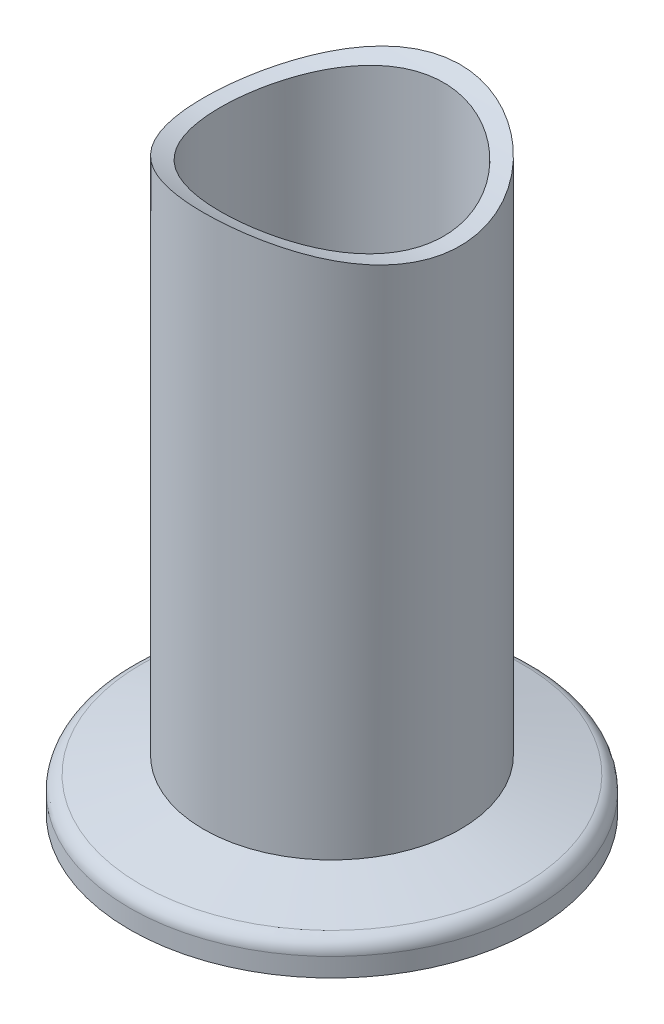
ISO-10303-21;
HEADER;
FILE_DESCRIPTION(('STEP AP214'),'2;1');
FILE_NAME('part.step','',(''),(''),'','','');
FILE_SCHEMA(('AUTOMOTIVE_DESIGN { 1 0 10303 214 1 1 1 1 }'));
ENDSEC;
DATA;
#1=APPLICATION_CONTEXT('core data for automotive mechanical design processes');
#2=APPLICATION_PROTOCOL_DEFINITION('international standard','automotive_design',2000,#1);
#3=PRODUCT_CONTEXT('',#1,'mechanical');
#4=PRODUCT('Part','Part','',(#3));
#5=PRODUCT_RELATED_PRODUCT_CATEGORY('part','',(#4));
#6=PRODUCT_DEFINITION_FORMATION('','',#4);
#7=PRODUCT_DEFINITION_CONTEXT('part definition',#1,'design');
#8=PRODUCT_DEFINITION('design','',#6,#7);
#9=PRODUCT_DEFINITION_SHAPE('','',#8);
#10=(LENGTH_UNIT() NAMED_UNIT(*) SI_UNIT(.MILLI.,.METRE.));
#11=(NAMED_UNIT(*) PLANE_ANGLE_UNIT() SI_UNIT($,.RADIAN.));
#12=(NAMED_UNIT(*) SI_UNIT($,.STERADIAN.) SOLID_ANGLE_UNIT());
#13=UNCERTAINTY_MEASURE_WITH_UNIT(LENGTH_MEASURE(1.E-05),#10,'distance_accuracy_value','');
#14=(GEOMETRIC_REPRESENTATION_CONTEXT(3) GLOBAL_UNCERTAINTY_ASSIGNED_CONTEXT((#13)) GLOBAL_UNIT_ASSIGNED_CONTEXT((#10,
#11,#12)) REPRESENTATION_CONTEXT('',''));
#15=CARTESIAN_POINT('',(0.,0.,0.));
#16=DIRECTION('',(0.,0.,1.));
#17=DIRECTION('',(1.,0.,0.));
#18=AXIS2_PLACEMENT_3D('',#15,#16,#17);
#19=CARTESIAN_POINT('',(0.,0.,0.));
#20=DIRECTION('',(0.,1.,0.));
#21=DIRECTION('',(0.,0.,1.));
#22=AXIS2_PLACEMENT_3D('',#19,#20,#21);
#23=CYLINDRICAL_SURFACE('',#22,12.7);
#24=CARTESIAN_POINT('',(0.,57.8030088282057,12.7));
#25=CARTESIAN_POINT('',(0.337966667612661,57.8030061327463,12.6999974802343));
#26=CARTESIAN_POINT('',(0.676043453065338,57.7966182835198,12.6864898318672));
#27=CARTESIAN_POINT('',(1.34972280775874,57.771278414815,12.6325992349375));
#28=CARTESIAN_POINT('',(1.68532367760534,57.7523184545045,12.5921993005315));
#29=CARTESIAN_POINT('',(2.35217061314407,57.7024292254738,12.4848547611177));
#30=CARTESIAN_POINT('',(2.68340452810274,57.6714718063177,12.4178477169149));
#31=CARTESIAN_POINT('',(3.33828785092914,57.5986361324553,12.2580356692884));
#32=CARTESIAN_POINT('',(3.66193837200279,57.5567594917241,12.1652344783752));
#33=CARTESIAN_POINT('',(4.29825940919649,57.4636196928336,11.9551977985834));
#34=CARTESIAN_POINT('',(4.61097047971219,57.412396870839,11.8380670215021));
#35=CARTESIAN_POINT('',(5.22501932792218,57.3019767853066,11.5801588828009));
#36=CARTESIAN_POINT('',(5.52635671433382,57.2427792477387,11.4393807085591));
#37=CARTESIAN_POINT('',(6.11590510471372,57.1181004070452,11.1353339021782));
#38=CARTESIAN_POINT('',(6.40412221208047,57.0526220706448,10.972075872646));
#39=CARTESIAN_POINT('',(6.96626047190927,56.9170594482911,10.6240549591742));
#40=CARTESIAN_POINT('',(7.24017636312289,56.8469734883729,10.4392842405965));
#41=CARTESIAN_POINT('',(7.78806715532096,56.6997298727472,10.0378316954649));
#42=CARTESIAN_POINT('',(8.06108678115527,56.6223991530217,9.81990866099743));
#43=CARTESIAN_POINT('',(8.58808973663291,56.4666168914696,9.3625031081281));
#44=CARTESIAN_POINT('',(8.84207230404262,56.3881653049137,9.12301972730567));
#45=CARTESIAN_POINT('',(9.32974520607019,56.2321245609378,8.62367146880821));
#46=CARTESIAN_POINT('',(9.56342411158536,56.1545359104249,8.36379526647405));
#47=CARTESIAN_POINT('',(10.0088686096585,56.0022636552798,7.82525528157904));
#48=CARTESIAN_POINT('',(10.2206417126304,55.9275790605081,7.54659799259991));
#49=CARTESIAN_POINT('',(10.6302435859891,55.7796323666945,6.95860255562527));
#50=CARTESIAN_POINT('',(10.8269750880218,55.7065956508943,6.64844157888177));
#51=CARTESIAN_POINT('',(11.1934462571668,55.5677901230862,6.01098351786343));
#52=CARTESIAN_POINT('',(11.3631848591593,55.5020215979069,5.68368575806093));
#53=CARTESIAN_POINT('',(11.6740486890053,55.3796673180838,5.01425191711402));
#54=CARTESIAN_POINT('',(11.8151842556186,55.323078246946,4.67212125189947));
#55=CARTESIAN_POINT('',(12.0674521674993,55.2207345111884,3.97540310396765));
#56=CARTESIAN_POINT('',(12.1785867306283,55.1749790457114,3.62081654425934));
#57=CARTESIAN_POINT('',(12.3644044197808,55.0978502925402,2.92150658714544));
#58=CARTESIAN_POINT('',(12.440738986275,55.0658310367963,2.57729288775198));
#59=CARTESIAN_POINT('',(12.5646062107959,55.013628304745,1.88283172671388));
#60=CARTESIAN_POINT('',(12.612139823187,54.9934444362545,1.53258446539629));
#61=CARTESIAN_POINT('',(12.6778387022792,54.9654976744835,0.828979889260723));
#62=CARTESIAN_POINT('',(12.6960146201975,54.9577302764143,0.475623749173587));
#63=CARTESIAN_POINT('',(12.7028114073386,54.9548290815981,-0.231418048780089));
#64=CARTESIAN_POINT('',(12.6914334906051,54.9596947658961,-0.585103692514299));
#65=CARTESIAN_POINT('',(12.6409356437175,54.981203029045,-1.26734899892231));
#66=CARTESIAN_POINT('',(12.6036353965208,54.9970729801937,-1.59606968833555));
#67=CARTESIAN_POINT('',(12.503655040455,55.0393502172284,-2.24892275822736));
#68=CARTESIAN_POINT('',(12.4409762243434,55.06575696638,-2.57305537154739));
#69=CARTESIAN_POINT('',(12.2908559746949,55.1284532245096,-3.21455865213643));
#70=CARTESIAN_POINT('',(12.2034136884611,55.1647430737972,-3.53192908615418));
#71=CARTESIAN_POINT('',(12.0045762984694,55.2463254896933,-4.15788370696592));
#72=CARTESIAN_POINT('',(11.8931804637008,55.2916183310506,-4.46646762528884));
#73=CARTESIAN_POINT('',(11.6455124939983,55.3908897072664,-5.07763834921836));
#74=CARTESIAN_POINT('',(11.5088869984911,55.444990132714,-5.38006200303765));
#75=CARTESIAN_POINT('',(11.2130185467921,55.5600908256936,-5.97225090629107));
#76=CARTESIAN_POINT('',(11.0537755415261,55.6210911081965,-6.26201612825794));
#77=CARTESIAN_POINT('',(10.7137909179858,55.7485950823373,-6.82740900951455));
#78=CARTESIAN_POINT('',(10.5330469412518,55.8150993774711,-7.10303511311769));
#79=CARTESIAN_POINT('',(10.1511591958667,55.9521291981164,-7.63886491712118));
#80=CARTESIAN_POINT('',(9.95000752243011,56.0226562771603,-7.89906257910987));
#81=CARTESIAN_POINT('',(9.51304274723571,56.1713967687574,-8.42117801865003));
#82=CARTESIAN_POINT('',(9.27576957001009,56.2497945738192,-8.68182274892644));
#83=CARTESIAN_POINT('',(8.78052275905956,56.4073546614007,-9.18239588296409));
#84=CARTESIAN_POINT('',(8.52254842513068,56.4865169696995,-9.42232358541421));
#85=CARTESIAN_POINT('',(7.98723422911562,56.6435465744278,-9.88019119199024));
#86=CARTESIAN_POINT('',(7.7098876415255,56.7214134093718,-10.0981233950494));
#87=CARTESIAN_POINT('',(7.13735252721722,56.8737070425595,-10.5105995002396));
#88=CARTESIAN_POINT('',(6.84216130411783,56.9481333179102,-10.7051398544462));
#89=CARTESIAN_POINT('',(6.22456415326808,57.0939944023599,-11.0760641781687));
#90=CARTESIAN_POINT('',(5.90155968174794,57.1652230991225,-11.25153483711));
#91=CARTESIAN_POINT('',(5.24027293932176,57.2993107427972,-11.5743181782834));
#92=CARTESIAN_POINT('',(4.90199753301278,57.3621734012172,-11.7216433596896));
#93=CARTESIAN_POINT('',(4.21244287313947,57.4773365456783,-11.9867301845126));
#94=CARTESIAN_POINT('',(3.86116861938318,57.5296410437991,-12.1045030618964));
#95=CARTESIAN_POINT('',(3.14814984961279,57.6217449858774,-12.3092114159778));
#96=CARTESIAN_POINT('',(2.78640632612038,57.6615456110303,-12.3961498055969));
#97=CARTESIAN_POINT('',(2.07999159044066,57.7248591081134,-12.5333265928779));
#98=CARTESIAN_POINT('',(1.7358037542267,57.7492857627233,-12.5856362950555));
#99=CARTESIAN_POINT('',(1.04361819608748,57.7849923664133,-12.6618351352494));
#100=CARTESIAN_POINT('',(0.695620647805092,57.7962729121827,-12.68572556319));
#101=CARTESIAN_POINT('',(-0.00122065961250493,57.8052641017779,-12.7047807071719));
#102=CARTESIAN_POINT('',(-0.350064106656494,57.8029791586195,-12.6999547649905));
#103=CARTESIAN_POINT('',(-1.04581526609033,57.7849350330202,-12.6616603408621));
#104=CARTESIAN_POINT('',(-1.39272304219663,57.7691762967613,-12.6281928073755));
#105=CARTESIAN_POINT('',(-2.05806925529534,57.726303598872,-12.5363179372171));
#106=CARTESIAN_POINT('',(-2.37682436573281,57.700045434639,-12.4797847987945));
#107=CARTESIAN_POINT('',(-3.008097320123,57.6371814615137,-12.3428383187926));
#108=CARTESIAN_POINT('',(-3.32061550899981,57.6005762265588,-12.2624263017282));
#109=CARTESIAN_POINT('',(-3.93750282258498,57.5181096275995,-12.0784799731984));
#110=CARTESIAN_POINT('',(-4.24187192779833,57.472248241454,-11.9749456064231));
#111=CARTESIAN_POINT('',(-4.84086694155246,57.3725473892013,-11.7455909527416));
#112=CARTESIAN_POINT('',(-5.13548897858233,57.3187047984319,-11.619761933636));
#113=CARTESIAN_POINT('',(-5.72576048759727,57.2020372352126,-11.3409316083568));
#114=CARTESIAN_POINT('',(-6.02091205241725,57.138926054436,-11.1869963509737));
#115=CARTESIAN_POINT('',(-6.59745572675304,57.0072909384594,-10.8569777603475));
#116=CARTESIAN_POINT('',(-6.87884172105822,56.938764632372,-10.6808847056151));
#117=CARTESIAN_POINT('',(-7.42641092739612,56.798072398071,-10.3076775764155));
#118=CARTESIAN_POINT('',(-7.69259165269597,56.7259058781351,-10.1105600785516));
#119=CARTESIAN_POINT('',(-8.20845492653064,56.5797063352229,-9.69642650917383));
#120=CARTESIAN_POINT('',(-8.45813669893488,56.5056732246659,-9.47940950270815));
#121=CARTESIAN_POINT('',(-8.96066245980031,56.3510654367521,-9.00697068974137));
#122=CARTESIAN_POINT('',(-9.21190940015589,56.2704792236385,-8.7498505927576));
#123=CARTESIAN_POINT('',(-9.69191134765971,56.1113726135354,-8.21498247880631));
#124=CARTESIAN_POINT('',(-9.9206738311838,56.0328515362655,-7.93724137288526));
#125=CARTESIAN_POINT('',(-10.3543722540419,55.8799241232123,-7.36251373145176));
#126=CARTESIAN_POINT('',(-10.5593004871702,55.8055191223137,-7.06552101948536));
#127=CARTESIAN_POINT('',(-10.9437203533913,55.662860352827,-6.45409786311612));
#128=CARTESIAN_POINT('',(-11.1232125300577,55.5946064528,-6.13966779155303));
#129=CARTESIAN_POINT('',(-11.4560342077919,55.4658246786327,-5.49380200425907));
#130=CARTESIAN_POINT('',(-11.6092380168829,55.405334252735,-5.16229393290836));
#131=CARTESIAN_POINT('',(-11.8869947234331,55.2941788493711,-4.48586894987199));
#132=CARTESIAN_POINT('',(-12.0115472349667,55.2435140042544,-4.14095185764339));
#133=CARTESIAN_POINT('',(-12.2306134861211,55.1535261468516,-3.44044930674045));
#134=CARTESIAN_POINT('',(-12.3251427110732,55.1141972886913,-3.08486945159388));
#135=CARTESIAN_POINT('',(-12.4831396497163,55.0480434215442,-2.36573843304101));
#136=CARTESIAN_POINT('',(-12.5466098386931,55.021217416136,-2.00218790728006));
#137=CARTESIAN_POINT('',(-12.6382444814566,54.982366023112,-1.29687727341984));
#138=CARTESIAN_POINT('',(-12.6686424546522,54.9694054729741,-0.9554571569384));
#139=CARTESIAN_POINT('',(-12.7017281344655,54.9552952239367,-0.271040365500603));
#140=CARTESIAN_POINT('',(-12.7044172604557,54.9541449200629,0.071956227801012));
#141=CARTESIAN_POINT('',(-12.6820582364973,54.9636855176633,0.756815057904461));
#142=CARTESIAN_POINT('',(-12.6570148307319,54.974374393818,1.09867747869524));
#143=CARTESIAN_POINT('',(-12.5794796602576,55.0072988750264,1.77870775903798));
#144=CARTESIAN_POINT('',(-12.5269881167943,55.0295343870085,2.11687564834725));
#145=CARTESIAN_POINT('',(-12.3976833000467,55.0838793286209,2.77402693420548));
#146=CARTESIAN_POINT('',(-12.3218897905213,55.1155733779091,3.09324632537784));
#147=CARTESIAN_POINT('',(-12.1461903928166,55.1883047897486,3.72386832392965));
#148=CARTESIAN_POINT('',(-12.0462853386826,55.2293418291124,4.03527120127987));
#149=CARTESIAN_POINT('',(-11.8232468951465,55.3197860330082,4.64835885453756));
#150=CARTESIAN_POINT('',(-11.7001147070444,55.3691927646489,4.95004413209194));
#151=CARTESIAN_POINT('',(-11.4315587878541,55.4752607586568,5.54212825253603));
#152=CARTESIAN_POINT('',(-11.2861264098466,55.5319248336556,5.83252266239228));
#153=CARTESIAN_POINT('',(-10.9670070999349,55.6539201328072,6.4132220240345));
#154=CARTESIAN_POINT('',(-10.7923408873164,55.7195271806138,6.7029308659257));
#155=CARTESIAN_POINT('',(-10.4210042161936,55.8557260472695,7.26682180017757));
#156=CARTESIAN_POINT('',(-10.2243239749792,55.9263200770788,7.540996907408));
#157=CARTESIAN_POINT('',(-9.81023862895041,56.0708123833086,8.07234038070148));
#158=CARTESIAN_POINT('',(-9.59283116344829,56.1447110355926,8.32950680392994));
#159=CARTESIAN_POINT('',(-9.1385428785784,56.294069459647,8.82553987331999));
#160=CARTESIAN_POINT('',(-8.90166128011877,56.3695292937843,9.06440578660298));
#161=CARTESIAN_POINT('',(-8.39186630094811,56.525665847573,9.53920926028083));
#162=CARTESIAN_POINT('',(-8.1175861177866,56.60632544622,9.77368745733191));
#163=CARTESIAN_POINT('',(-7.54971513534199,56.7650838685574,10.2187028814211));
#164=CARTESIAN_POINT('',(-7.25613113842312,56.8431835799285,10.4292484713267));
#165=CARTESIAN_POINT('',(-6.65094548630251,56.9946289736625,10.8252385804105));
#166=CARTESIAN_POINT('',(-6.33932875267145,57.0679705654981,11.0106616471133));
#167=CARTESIAN_POINT('',(-5.70013805783453,57.2075411337302,11.3547410749687));
#168=CARTESIAN_POINT('',(-5.37256519908249,57.2737706005133,11.5133992820099));
#169=CARTESIAN_POINT('',(-4.70427332156241,57.396779830545,11.8022033517062));
#170=CARTESIAN_POINT('',(-4.36358633031622,57.4535810142598,11.9324140643441));
#171=CARTESIAN_POINT('',(-3.67064877334715,57.5559135266228,12.1634583268609));
#172=CARTESIAN_POINT('',(-3.31839619494383,57.6014428818114,12.2642867330638));
#173=CARTESIAN_POINT('',(-2.60619472215657,57.6793787221364,12.4350902538913));
#174=CARTESIAN_POINT('',(-2.24627200854666,57.7118240633302,12.5051567789698));
#175=CARTESIAN_POINT('',(-1.52091630213525,57.7624764289002,12.6139254583757));
#176=CARTESIAN_POINT('',(-1.15548776109444,57.7806943868924,12.6526516982619));
#177=CARTESIAN_POINT('',(-0.657692861943612,57.7952921559354,12.683642206207));
#178=CARTESIAN_POINT('',(-0.526252650435774,57.7981836935589,12.689774385749));
#179=CARTESIAN_POINT('',(-0.263213860922235,57.8020425689272,12.6979538038194));
#180=CARTESIAN_POINT('',(-0.131615280578433,57.8030098779058,12.7000009812792));
#181=CARTESIAN_POINT('',(0.,57.8030088282057,12.7));
#182=B_SPLINE_CURVE_WITH_KNOTS('',3,(#24,#25,#26,#27,#28,#29,#30,#31,#32,#33,#34,#35,#36,#37,
#38,#39,#40,#41,#42,#43,#44,#45,#46,#47,#48,#49,#50,#51,#52,#53,#54,#55,#56,#57,#58,#59,#60,#61,
#62,#63,#64,#65,#66,#67,#68,#69,#70,#71,#72,#73,#74,#75,#76,#77,#78,#79,#80,#81,#82,#83,#84,#85,
#86,#87,#88,#89,#90,#91,#92,#93,#94,#95,#96,#97,#98,#99,#100,#101,#102,#103,#104,#105,#106,#107,
#108,#109,#110,#111,#112,#113,#114,#115,#116,#117,#118,#119,#120,#121,#122,#123,#124,#125,#126,
#127,#128,#129,#130,#131,#132,#133,#134,#135,#136,#137,#138,#139,#140,#141,#142,#143,#144,#145,
#146,#147,#148,#149,#150,#151,#152,#153,#154,#155,#156,#157,#158,#159,#160,#161,#162,#163,#164,
#165,#166,#167,#168,#169,#170,#171,#172,#173,#174,#175,#176,#177,#178,#179,#180,#181),
.UNSPECIFIED.,.T.,.F.,(4,2,2,2,2,2,2,2,2,2,2,2,2,2,2,2,2,2,2,2,2,2,2,2,2,2,2,2,2,2,2,2,2,2,2,2,
2,2,2,2,2,2,2,2,2,2,2,2,2,2,2,2,2,2,2,2,2,2,2,2,2,2,2,2,2,2,2,2,2,2,2,2,2,2,2,2,2,2,4),(0.,
1.01376314708749,2.02816722080144,3.04496601114287,4.06161459311587,5.07397507820695,
6.08637035929852,7.0982897701365,8.11057886828568,9.18275769317648,10.2549794246261,
11.3278008604734,12.4002532513226,13.5222856808528,14.6443623739669,15.7660327586747,
16.8876201997739,17.9483143396816,19.0089733299164,20.0692474176882,21.1294779510895,
22.12194123783,23.1143539758959,24.1068008905164,25.0992780967798,26.1068861210422,
27.1144963315832,28.1222171698357,29.1303298432135,30.2123681202161,31.2944430119412,
32.3768954550891,33.4595118710809,34.5813564669729,35.7027016969099,36.8236200124277,
37.94443240702,38.9900307977784,40.0355817279927,41.0807925466309,42.1259687546695,
43.0992395554611,44.0724563808949,45.0456755343429,46.019276716892,47.0346357048941,
48.050441733961,49.0664134193239,50.0824328632439,51.1863988358599,52.2899964745945,
53.3939499477258,54.4978798255896,55.6069491039116,56.7160333202399,57.8245445635711,
58.9329674484206,59.9607122974103,60.9884045003957,62.0159209240135,63.0434290654717,
64.0311763792922,65.0188895307153,66.0065516119223,66.994597632989,68.0272575112999,
69.060378124189,70.093616543266,71.1268963187279,72.2348552476072,73.3424258199595,
74.4509362805417,75.5593702593392,76.6652504156139,77.7713240514826,78.8740883140186,
79.9760042759197,80.3707909197452,80.7655834653726),.UNSPECIFIED.);
#183=CARTESIAN_POINT('',(0.,57.8030088282057,12.7));
#184=VERTEX_POINT('',#183);
#185=EDGE_CURVE('E78',#184,#184,#182,.T.);
#186=ORIENTED_EDGE('',*,*,#185,.F.);
#187=EDGE_LOOP('',(#186));
#188=FACE_BOUND('',#187,.T.);
#189=CARTESIAN_POINT('',(0.,4.95602910474715,0.));
#190=DIRECTION('',(0.,1.,0.));
#191=DIRECTION('',(0.,0.,1.));
#192=AXIS2_PLACEMENT_3D('',#189,#190,#191);
#193=CIRCLE('',#192,12.7);
#194=CARTESIAN_POINT('',(0.,4.95602910474715,12.7));
#195=VERTEX_POINT('',#194);
#196=EDGE_CURVE('E10',#195,#195,#193,.T.);
#197=ORIENTED_EDGE('',*,*,#196,.T.);
#198=EDGE_LOOP('',(#197));
#199=FACE_BOUND('',#198,.T.);
#200=ADVANCED_FACE('F37',(#188,#199),#23,.T.);
#201=CARTESIAN_POINT('',(0.,4.95602910474715,0.));
#202=DIRECTION('',(0.,-1.,0.));
#203=DIRECTION('',(0.,0.,-1.));
#204=AXIS2_PLACEMENT_3D('',#201,#202,#203);
#205=CONICAL_SURFACE('',#204,12.7,1.30899693899575);
#206=CARTESIAN_POINT('',(0.,3.29789825746515,0.));
#207=DIRECTION('',(0.,1.,0.));
#208=DIRECTION('',(0.,0.,1.));
#209=AXIS2_PLACEMENT_3D('',#206,#207,#208);
#210=CIRCLE('',#209,18.8882285676538);
#211=CARTESIAN_POINT('',(0.,3.29789825746515,18.8882285676538));
#212=VERTEX_POINT('',#211);
#213=EDGE_CURVE('E51',#212,#212,#210,.T.);
#214=ORIENTED_EDGE('',*,*,#213,.T.);
#215=EDGE_LOOP('',(#214));
#216=FACE_BOUND('',#215,.T.);
#217=ORIENTED_EDGE('',*,*,#196,.F.);
#218=EDGE_LOOP('',(#217));
#219=FACE_BOUND('',#218,.T.);
#220=ADVANCED_FACE('F112',(#216,#219),#205,.T.);
#221=CARTESIAN_POINT('',(0.,1.84900951803155,0.));
#222=DIRECTION('',(0.,1.,0.));
#223=DIRECTION('',(0.,0.,1.));
#224=AXIS2_PLACEMENT_3D('',#221,#222,#223);
#225=TOROIDAL_SURFACE('',#224,18.5,1.5);
#226=CARTESIAN_POINT('',(0.,1.84900951803155,0.));
#227=DIRECTION('',(0.,1.,0.));
#228=DIRECTION('',(0.,0.,1.));
#229=AXIS2_PLACEMENT_3D('',#226,#227,#228);
#230=CIRCLE('',#229,20.);
#231=CARTESIAN_POINT('',(0.,1.84900951803155,20.));
#232=VERTEX_POINT('',#231);
#233=EDGE_CURVE('E56',#232,#232,#230,.T.);
#234=ORIENTED_EDGE('',*,*,#233,.T.);
#235=EDGE_LOOP('',(#234));
#236=FACE_BOUND('',#235,.T.);
#237=ORIENTED_EDGE('',*,*,#213,.F.);
#238=EDGE_LOOP('',(#237));
#239=FACE_BOUND('',#238,.T.);
#240=ADVANCED_FACE('F109',(#236,#239),#225,.T.);
#241=CARTESIAN_POINT('',(0.,0.,0.));
#242=DIRECTION('',(0.,1.,0.));
#243=DIRECTION('',(0.,0.,1.));
#244=AXIS2_PLACEMENT_3D('',#241,#242,#243);
#245=CYLINDRICAL_SURFACE('',#244,20.);
#246=CARTESIAN_POINT('',(0.,0.,0.));
#247=DIRECTION('',(0.,1.,0.));
#248=DIRECTION('',(0.,0.,1.));
#249=AXIS2_PLACEMENT_3D('',#246,#247,#248);
#250=CIRCLE('',#249,20.);
#251=CARTESIAN_POINT('',(0.,0.,20.));
#252=VERTEX_POINT('',#251);
#253=EDGE_CURVE('E62',#252,#252,#250,.T.);
#254=ORIENTED_EDGE('',*,*,#253,.T.);
#255=EDGE_LOOP('',(#254));
#256=FACE_BOUND('',#255,.T.);
#257=ORIENTED_EDGE('',*,*,#233,.F.);
#258=EDGE_LOOP('',(#257));
#259=FACE_BOUND('',#258,.T.);
#260=ADVANCED_FACE('F105',(#256,#259),#245,.T.);
#261=CARTESIAN_POINT('',(20.,0.,0.));
#262=DIRECTION('',(0.,-1.,0.));
#263=DIRECTION('',(0.,0.,-1.));
#264=AXIS2_PLACEMENT_3D('',#261,#262,#263);
#265=PLANE('',#264);
#266=CARTESIAN_POINT('',(0.,0.,0.));
#267=DIRECTION('',(0.,1.,0.));
#268=DIRECTION('',(0.,0.,1.));
#269=AXIS2_PLACEMENT_3D('',#266,#267,#268);
#270=CIRCLE('',#269,11.85);
#271=CARTESIAN_POINT('',(0.,0.,11.85));
#272=VERTEX_POINT('',#271);
#273=EDGE_CURVE('E66',#272,#272,#270,.T.);
#274=ORIENTED_EDGE('',*,*,#273,.T.);
#275=EDGE_LOOP('',(#274));
#276=FACE_BOUND('',#275,.T.);
#277=ORIENTED_EDGE('',*,*,#253,.F.);
#278=EDGE_LOOP('',(#277));
#279=FACE_BOUND('',#278,.T.);
#280=ADVANCED_FACE('F101',(#276,#279),#265,.T.);
#281=CARTESIAN_POINT('',(0.,0.,0.));
#282=DIRECTION('',(0.,1.,0.));
#283=DIRECTION('',(0.,0.,1.));
#284=AXIS2_PLACEMENT_3D('',#281,#282,#283);
#285=CYLINDRICAL_SURFACE('',#284,11.85);
#286=CARTESIAN_POINT('',(0.,2.5,0.));
#287=DIRECTION('',(0.,1.,0.));
#288=DIRECTION('',(0.,0.,1.));
#289=AXIS2_PLACEMENT_3D('',#286,#287,#288);
#290=CIRCLE('',#289,11.85);
#291=CARTESIAN_POINT('',(0.,2.5,11.85));
#292=VERTEX_POINT('',#291);
#293=EDGE_CURVE('E70',#292,#292,#290,.T.);
#294=ORIENTED_EDGE('',*,*,#293,.T.);
#295=EDGE_LOOP('',(#294));
#296=FACE_BOUND('',#295,.T.);
#297=ORIENTED_EDGE('',*,*,#273,.F.);
#298=EDGE_LOOP('',(#297));
#299=FACE_BOUND('',#298,.T.);
#300=ADVANCED_FACE('F97',(#296,#299),#285,.F.);
#301=CARTESIAN_POINT('',(11.85,2.5,0.));
#302=DIRECTION('',(0.,-1.,0.));
#303=DIRECTION('',(0.,0.,-1.));
#304=AXIS2_PLACEMENT_3D('',#301,#302,#303);
#305=PLANE('',#304);
#306=CARTESIAN_POINT('',(0.,2.5,0.));
#307=DIRECTION('',(0.,1.,0.));
#308=DIRECTION('',(0.,0.,1.));
#309=AXIS2_PLACEMENT_3D('',#306,#307,#308);
#310=CIRCLE('',#309,11.05);
#311=CARTESIAN_POINT('',(0.,2.5,11.05));
#312=VERTEX_POINT('',#311);
#313=EDGE_CURVE('E74',#312,#312,#310,.T.);
#314=ORIENTED_EDGE('',*,*,#313,.T.);
#315=EDGE_LOOP('',(#314));
#316=FACE_BOUND('',#315,.T.);
#317=ORIENTED_EDGE('',*,*,#293,.F.);
#318=EDGE_LOOP('',(#317));
#319=FACE_BOUND('',#318,.T.);
#320=ADVANCED_FACE('F93',(#316,#319),#305,.T.);
#321=CARTESIAN_POINT('',(0.,0.,0.));
#322=DIRECTION('',(0.,1.,0.));
#323=DIRECTION('',(0.,0.,1.));
#324=AXIS2_PLACEMENT_3D('',#321,#322,#323);
#325=CYLINDRICAL_SURFACE('',#324,11.05);
#326=CARTESIAN_POINT('',(0.,57.0842985289849,11.05));
#327=CARTESIAN_POINT('',(-0.298597184758878,57.0842997121166,11.0500013157481));
#328=CARTESIAN_POINT('',(-0.597176428118643,57.0794436965934,11.0378870330381));
#329=CARTESIAN_POINT('',(-1.19205060604606,57.0601861839306,10.9895655346636));
#330=CARTESIAN_POINT('',(-1.48834571430911,57.0457854200047,10.95336016964));
#331=CARTESIAN_POINT('',(-2.07645532979295,57.0079147350347,10.8572380228784));
#332=CARTESIAN_POINT('',(-2.36826998023025,56.9844451045044,10.7973220006906));
#333=CARTESIAN_POINT('',(-2.94537446224905,56.9291913502531,10.65437216875));
#334=CARTESIAN_POINT('',(-3.23066411379974,56.8974069974212,10.571337721969));
#335=CARTESIAN_POINT('',(-3.7920786624542,56.8266011863231,10.3831626171885));
#336=CARTESIAN_POINT('',(-4.06822554554333,56.7875988424848,10.2780802496381));
#337=CARTESIAN_POINT('',(-4.61053394767,56.703435893454,10.0465140556617));
#338=CARTESIAN_POINT('',(-4.87669170270414,56.6582729960293,9.92002225893015));
#339=CARTESIAN_POINT('',(-5.3973870651083,56.5630680563968,9.64661530285878));
#340=CARTESIAN_POINT('',(-5.65192442554922,56.5130259105775,9.49969970978888));
#341=CARTESIAN_POINT('',(-6.14800154245442,56.4094026944047,9.18643812420254));
#342=CARTESIAN_POINT('',(-6.38954039002996,56.3558213771654,9.02009077554068));
#343=CARTESIAN_POINT('',(-6.8687266831948,56.244076662791,8.66121354072768));
#344=CARTESIAN_POINT('',(-7.10572739249095,56.1858154344779,8.46785007407591));
#345=CARTESIAN_POINT('',(-7.56279270078432,56.0685181725844,8.06225937121909));
#346=CARTESIAN_POINT('',(-7.78285690524543,56.0094821209919,7.85003169582005));
#347=CARTESIAN_POINT('',(-8.20479909297168,55.8921844681887,7.40791232315387));
#348=CARTESIAN_POINT('',(-8.40667303836043,55.833923041364,7.17801672484109));
#349=CARTESIAN_POINT('',(-8.79091256849727,55.7197135623748,6.70193461854952));
#350=CARTESIAN_POINT('',(-8.973278754097,55.6637654389917,6.45574861270408));
#351=CARTESIAN_POINT('',(-9.32306966712521,55.553822803419,5.93996596837627));
#352=CARTESIAN_POINT('',(-9.48978586604371,55.4999572242054,5.66986051256694));
#353=CARTESIAN_POINT('',(-9.79968688373237,55.3977971017913,5.11560382862165));
#354=CARTESIAN_POINT('',(-9.94288113524298,55.3495003277231,4.83145829057755));
#355=CARTESIAN_POINT('',(-10.2045664358662,55.2598398856351,4.25096189254585));
#356=CARTESIAN_POINT('',(-10.3230586692942,55.2184758852484,3.95461161851923));
#357=CARTESIAN_POINT('',(-10.534208413233,55.1438948555265,3.35185194806207));
#358=CARTESIAN_POINT('',(-10.6268673244067,55.1106773845045,3.04544309800705));
#359=CARTESIAN_POINT('',(-10.7820333081029,55.0546001852895,2.43809202786503));
#360=CARTESIAN_POINT('',(-10.8456519781406,55.0313610944473,2.13746863122217));
#361=CARTESIAN_POINT('',(-10.9476793150958,54.9939200610834,1.53141555116737));
#362=CARTESIAN_POINT('',(-10.9860886322596,54.9797178854651,1.22598599193296));
#363=CARTESIAN_POINT('',(-11.0372841015947,54.9607593244494,0.612778112981001));
#364=CARTESIAN_POINT('',(-11.0500772430962,54.9560003624904,0.305000456950424));
#365=CARTESIAN_POINT('',(-11.0499220618782,54.9560581051548,-0.310543071688172));
#366=CARTESIAN_POINT('',(-11.0369745005537,54.9608745265439,-0.618308944375453));
#367=CARTESIAN_POINT('',(-10.98673549242,54.9794778119344,-1.2164718404579));
#368=CARTESIAN_POINT('',(-10.95065833072,54.9928171184795,-1.50698576964874));
#369=CARTESIAN_POINT('',(-10.8556855949309,55.0276875214727,-2.08374738620326));
#370=CARTESIAN_POINT('',(-10.7967908975462,55.049218303184,-2.36999523704112));
#371=CARTESIAN_POINT('',(-10.6567229359527,55.0999235434147,-2.93629764977849));
#372=CARTESIAN_POINT('',(-10.5755488723559,55.1290982761987,-3.21635198906387));
#373=CARTESIAN_POINT('',(-10.3916275662282,55.1943613054121,-3.7684538202342));
#374=CARTESIAN_POINT('',(-10.288879768726,55.2304497796913,-4.04050110593719));
#375=CARTESIAN_POINT('',(-10.0610316651918,55.3092134285292,-4.57872865955407));
#376=CARTESIAN_POINT('',(-9.93563403813206,55.351975038633,-4.84477031676198));
#377=CARTESIAN_POINT('',(-9.66441495152711,55.4426632310471,-5.36542456965064));
#378=CARTESIAN_POINT('',(-9.51858612515428,55.4905916749065,-5.62003299895911));
#379=CARTESIAN_POINT('',(-9.20754912802905,55.5904444148134,-6.11631474993033));
#380=CARTESIAN_POINT('',(-9.04233970302004,55.6423689694029,-6.35798723294027));
#381=CARTESIAN_POINT('',(-8.69359922316355,55.7489728570937,-6.82709791687891));
#382=CARTESIAN_POINT('',(-8.51006694812823,55.8036523735381,-7.05453516818669));
#383=CARTESIAN_POINT('',(-8.11470530927671,55.9176531868608,-7.50661962049542));
#384=CARTESIAN_POINT('',(-7.90185545938902,55.9770605544778,-7.7303535949503));
#385=CARTESIAN_POINT('',(-7.45818941616444,56.0959099522916,-8.15923486483805));
#386=CARTESIAN_POINT('',(-7.22737261243286,56.1553519835978,-8.36438152828791));
#387=CARTESIAN_POINT('',(-6.74907179132904,56.2726646160125,-8.75487668680808));
#388=CARTESIAN_POINT('',(-6.50158334223029,56.330534793502,-8.94021988350707));
#389=CARTESIAN_POINT('',(-5.99145095836691,56.4430567520392,-9.28981286370373));
#390=CARTESIAN_POINT('',(-5.72880770047498,56.4977086766068,-9.45406358821796));
#391=CARTESIAN_POINT('',(-5.18404907471098,56.6033345274504,-9.76362623300612));
#392=CARTESIAN_POINT('',(-4.90163441456943,56.6542025880197,-9.90844846680102));
#393=CARTESIAN_POINT('',(-4.32457066891781,56.749259314959,-10.1735618852789));
#394=CARTESIAN_POINT('',(-4.0299268308207,56.7934508091658,-10.2938634631813));
#395=CARTESIAN_POINT('',(-3.43042373182466,56.8736809002112,-10.5088567793788));
#396=CARTESIAN_POINT('',(-3.12556677027563,56.909721318182,-10.603554239131));
#397=CARTESIAN_POINT('',(-2.50789353023052,56.9723821374737,-10.7663808343593));
#398=CARTESIAN_POINT('',(-2.19507778718886,56.9990031707292,-10.8345117521823));
#399=CARTESIAN_POINT('',(-1.58117253658084,57.0406812794305,-10.9404792927972));
#400=CARTESIAN_POINT('',(-1.28036917075885,57.0562879972511,-10.9797605703254));
#401=CARTESIAN_POINT('',(-0.67620490293015,57.0776716368448,-11.0334585921459));
#402=CARTESIAN_POINT('',(-0.372844094169355,57.0834489154609,-11.0478762390749));
#403=CARTESIAN_POINT('',(0.233992859140324,57.0849736455389,-11.0516875651506));
#404=CARTESIAN_POINT('',(0.537468965049304,57.0807232457905,-11.0410866054305));
#405=CARTESIAN_POINT('',(1.14221725723663,57.0623441477024,-10.9949895923599));
#406=CARTESIAN_POINT('',(1.44348948459731,57.0482156339764,-10.9594940042693));
#407=CARTESIAN_POINT('',(2.02760203280965,57.0114416602508,-10.8662183672671));
#408=CARTESIAN_POINT('',(2.31064804690836,56.9892227512552,-10.8095512014466));
#409=CARTESIAN_POINT('',(2.87085208542102,56.9369098227644,-10.6744441529774));
#410=CARTESIAN_POINT('',(3.14800801096859,56.906813045316,-10.59599664469));
#411=CARTESIAN_POINT('',(3.69452300086228,56.8396343200339,-10.4180407911207));
#412=CARTESIAN_POINT('',(3.96388378576452,56.8025539274123,-10.3185371343167));
#413=CARTESIAN_POINT('',(4.49339501303242,56.7224255906263,-10.0992109133218));
#414=CARTESIAN_POINT('',(4.75354182889677,56.6793753288556,-9.97938045386249));
#415=CARTESIAN_POINT('',(5.27241880669225,56.5868032278075,-9.71554840282894));
#416=CARTESIAN_POINT('',(5.53074885214736,56.5371022321562,-9.57082283001826));
#417=CARTESIAN_POINT('',(6.03453241019157,56.4338740364974,-9.2614438775902));
#418=CARTESIAN_POINT('',(6.27998012591391,56.3803451391541,-9.09678163511169));
#419=CARTESIAN_POINT('',(6.75658462999301,56.2708813231413,-8.74860934871693));
#420=CARTESIAN_POINT('',(6.98774007795426,56.2149461796345,-8.56509754128273));
#421=CARTESIAN_POINT('',(7.43450838928218,56.10209253731,-8.18031225214197));
#422=CARTESIAN_POINT('',(7.65012075940812,56.0451740073568,-7.97903820722274));
#423=CARTESIAN_POINT('',(8.0775409352256,55.9282283386425,-7.54677878904997));
#424=CARTESIAN_POINT('',(8.28827608398182,55.8682282922614,-7.31472378786357));
#425=CARTESIAN_POINT('',(8.68944342109399,55.7503790806726,-6.83331637385839));
#426=CARTESIAN_POINT('',(8.87988273133941,55.6925291656469,-6.58397007965785));
#427=CARTESIAN_POINT('',(9.23929795128078,55.5805171103858,-6.06930188480189));
#428=CARTESIAN_POINT('',(9.40826454502957,55.5263565754856,-5.80397312323043));
#429=CARTESIAN_POINT('',(9.72327590867885,55.4232706194082,-5.25921628538736));
#430=CARTESIAN_POINT('',(9.86933048352144,55.3743429617481,-4.97979430817376));
#431=CARTESIAN_POINT('',(10.1368954903551,55.2832339074667,-4.40961054992244));
#432=CARTESIAN_POINT('',(10.2584916516606,55.241029058934,-4.1188927951326));
#433=CARTESIAN_POINT('',(10.4766727928135,55.1643596585483,-3.52721441445989));
#434=CARTESIAN_POINT('',(10.5732576548646,55.1298951431503,-3.22625374034324));
#435=CARTESIAN_POINT('',(10.7404181406028,55.0697253860876,-2.61645317651538));
#436=CARTESIAN_POINT('',(10.8110036331526,55.0440168211118,-2.30761632414559));
#437=CARTESIAN_POINT('',(10.9254590704148,55.0021099894324,-1.68439934943829));
#438=CARTESIAN_POINT('',(10.9693305155155,54.9859111886169,-1.37001953944038));
#439=CARTESIAN_POINT('',(11.0281366550562,54.9641544715896,-0.756425269973044));
#440=CARTESIAN_POINT('',(11.0445862412431,54.9580397025862,-0.45737478566594));
#441=CARTESIAN_POINT('',(11.0531507587794,54.9548590126556,0.141116222840829));
#442=CARTESIAN_POINT('',(11.0452666779175,54.957792724419,0.440556730714849));
#443=CARTESIAN_POINT('',(11.005247985516,54.9726280082199,1.03755120802735));
#444=CARTESIAN_POINT('',(10.9731160614985,54.9845285864101,1.33510538285316));
#445=CARTESIAN_POINT('',(10.8849284852997,55.0169740676115,1.92616562554198));
#446=CARTESIAN_POINT('',(10.8288728412165,55.0375189676968,2.21967169477521));
#447=CARTESIAN_POINT('',(10.6949863543108,55.0861212157819,2.79366398294052));
#448=CARTESIAN_POINT('',(10.6177015726868,55.1139894988316,3.07429396647778));
#449=CARTESIAN_POINT('',(10.4415253389171,55.1767439782586,3.6278670197672));
#450=CARTESIAN_POINT('',(10.3426343729521,55.2116300167214,3.90081026232987));
#451=CARTESIAN_POINT('',(10.1240563319709,55.2875651793571,4.43732931394776));
#452=CARTESIAN_POINT('',(10.004370061065,55.3286140652174,4.70090548473317));
#453=CARTESIAN_POINT('',(9.74505248536516,55.41590890612,5.21727525064167));
#454=CARTESIAN_POINT('',(9.60541360730172,55.4621568330976,5.47006470399741));
#455=CARTESIAN_POINT('',(9.30102123509432,55.5607478916519,5.97357384232258));
#456=CARTESIAN_POINT('',(9.13546856027668,55.6132638919379,6.22377664962098));
#457=CARTESIAN_POINT('',(8.78488765607583,55.7214392906228,6.70954593565179));
#458=CARTESIAN_POINT('',(8.59985267698045,55.7770997753235,6.94510729655593));
#459=CARTESIAN_POINT('',(8.21148526981591,55.8901657376088,7.40023746896));
#460=CARTESIAN_POINT('',(8.00815026253503,55.9475714604104,7.61980401823068));
#461=CARTESIAN_POINT('',(7.58438940193778,56.0626810876759,8.04169995847542));
#462=CARTESIAN_POINT('',(7.36396286119581,56.120385004046,8.24402865545128));
#463=CARTESIAN_POINT('',(6.89540919311601,56.2375799113671,8.64029981324748));
#464=CARTESIAN_POINT('',(6.64643861981695,56.2970086282202,8.83326489282409));
#465=CARTESIAN_POINT('',(6.13254900651017,56.4128227753998,9.19747206540695));
#466=CARTESIAN_POINT('',(5.86763549139576,56.4692092472901,9.36872162055237));
#467=CARTESIAN_POINT('',(5.32326395365097,56.5772900592204,9.68839698716737));
#468=CARTESIAN_POINT('',(5.04379856190801,56.6289819848462,9.83681108124895));
#469=CARTESIAN_POINT('',(4.47237508505941,56.7259842481218,10.1094276404021));
#470=CARTESIAN_POINT('',(4.18042241924195,56.7712973181849,10.2336404810067));
#471=CARTESIAN_POINT('',(3.57518326623087,56.8555539829953,10.4608203815927));
#472=CARTESIAN_POINT('',(3.26150711250158,56.894208907269,10.562859596436));
#473=CARTESIAN_POINT('',(2.62526968762899,56.9616242585353,10.7386863311516));
#474=CARTESIAN_POINT('',(2.30270808426228,56.9903843150188,10.8124727931237));
#475=CARTESIAN_POINT('',(1.65165824513383,57.036865390516,10.9308707162657));
#476=CARTESIAN_POINT('',(1.32317324728438,57.0545922630101,10.9754976481879));
#477=CARTESIAN_POINT('',(0.663117906195898,57.078307554105,11.035059988068));
#478=CARTESIAN_POINT('',(0.331547893293721,57.0842972152925,11.0499985390568));
#479=CARTESIAN_POINT('',(0.,57.0842985289849,11.05));
#480=B_SPLINE_CURVE_WITH_KNOTS('',3,(#326,#327,#328,#329,#330,#331,#332,#333,#334,#335,#336,
#337,#338,#339,#340,#341,#342,#343,#344,#345,#346,#347,#348,#349,#350,#351,#352,#353,#354,#355,
#356,#357,#358,#359,#360,#361,#362,#363,#364,#365,#366,#367,#368,#369,#370,#371,#372,#373,#374,
#375,#376,#377,#378,#379,#380,#381,#382,#383,#384,#385,#386,#387,#388,#389,#390,#391,#392,#393,
#394,#395,#396,#397,#398,#399,#400,#401,#402,#403,#404,#405,#406,#407,#408,#409,#410,#411,#412,
#413,#414,#415,#416,#417,#418,#419,#420,#421,#422,#423,#424,#425,#426,#427,#428,#429,#430,#431,
#432,#433,#434,#435,#436,#437,#438,#439,#440,#441,#442,#443,#444,#445,#446,#447,#448,#449,#450,
#451,#452,#453,#454,#455,#456,#457,#458,#459,#460,#461,#462,#463,#464,#465,#466,#467,#468,#469,
#470,#471,#472,#473,#474,#475,#476,#477,#478,#479),.UNSPECIFIED.,.T.,.F.,(4,2,2,2,2,2,2,2,2,2,2,
2,2,2,2,2,2,2,2,2,2,2,2,2,2,2,2,2,2,2,2,2,2,2,2,2,2,2,2,2,2,2,2,2,2,2,2,2,2,2,2,2,2,2,2,2,2,2,2,
2,2,2,2,2,2,2,2,2,2,2,2,2,2,2,2,2,4),(0.,0.895477201882176,1.79088562248581,2.68626536178636,
3.58166977571882,4.47473608775261,5.36813560488084,6.26155409759119,7.15503497941937,
8.08810870706557,9.02120416410242,9.95450624215256,10.8877795656124,11.8524318499053,
12.8166963411907,13.7809145910691,14.7450805516043,15.6683772038417,16.5916500397699,
17.5146709279224,18.4376645140599,19.3157793184928,20.1938603869956,21.0719729653432,
21.9501081353795,22.8407414528458,23.7316967342281,24.6227097075167,25.5137820563563,
26.4561167412774,27.3984834542956,28.3411016673066,29.2836778118612,30.246757395245,
31.2094279190962,32.1718831479464,33.1342737946485,34.0443831787779,34.9544595220624,
35.8643408665755,36.7742052066175,37.6417642215732,38.5096273663804,39.3772974709621,
40.2453053680009,41.1450732174299,42.0452425381737,42.9454961533397,43.8457783243987,
44.8021122068926,45.7581093954064,46.7145199379371,47.6705200721581,48.6231085804676,
49.5757015751236,50.5279326101974,51.4801101585011,52.3776937369098,53.2752408797437,
54.172688557095,55.0701359306662,55.9463687937286,56.8225819418923,57.6987612162984,
58.5752739436644,59.4879948874166,60.401033093555,61.3142001857109,62.2274040247382,
63.1879142421731,64.1480934983749,65.1087638127338,66.0690213589911,67.0639123223657,
68.0588405349432,69.0532404532261,70.04753509139),.UNSPECIFIED.);
#481=CARTESIAN_POINT('',(0.,57.0842985289849,11.05));
#482=VERTEX_POINT('',#481);
#483=EDGE_CURVE('E41',#482,#482,#480,.T.);
#484=ORIENTED_EDGE('',*,*,#483,.F.);
#485=EDGE_LOOP('',(#484));
#486=FACE_BOUND('',#485,.T.);
#487=ORIENTED_EDGE('',*,*,#313,.F.);
#488=EDGE_LOOP('',(#487));
#489=FACE_BOUND('',#488,.T.);
#490=ADVANCED_FACE('F87',(#486,#489),#325,.F.);
#491=CARTESIAN_POINT('',(-20.,84.7060291047471,0.));
#492=DIRECTION('',(1.,0.,0.));
#493=DIRECTION('',(0.,0.,-1.));
#494=AXIS2_PLACEMENT_3D('',#491,#492,#493);
#495=CYLINDRICAL_SURFACE('',#494,29.75);
#496=ORIENTED_EDGE('',*,*,#185,.T.);
#497=EDGE_LOOP('',(#496));
#498=FACE_BOUND('',#497,.T.);
#499=ORIENTED_EDGE('',*,*,#483,.T.);
#500=EDGE_LOOP('',(#499));
#501=FACE_BOUND('',#500,.T.);
#502=ADVANCED_FACE('F84',(#498,#501),#495,.F.);
#503=CLOSED_SHELL('',(#200,#220,#240,#260,#280,#300,#320,#490,#502));
#504=MANIFOLD_SOLID_BREP('B2',#503);
#505=ADVANCED_BREP_SHAPE_REPRESENTATION('',(#18,#504),#14);
#506=SHAPE_DEFINITION_REPRESENTATION(#9,#505);
ENDSEC;
END-ISO-10303-21;
